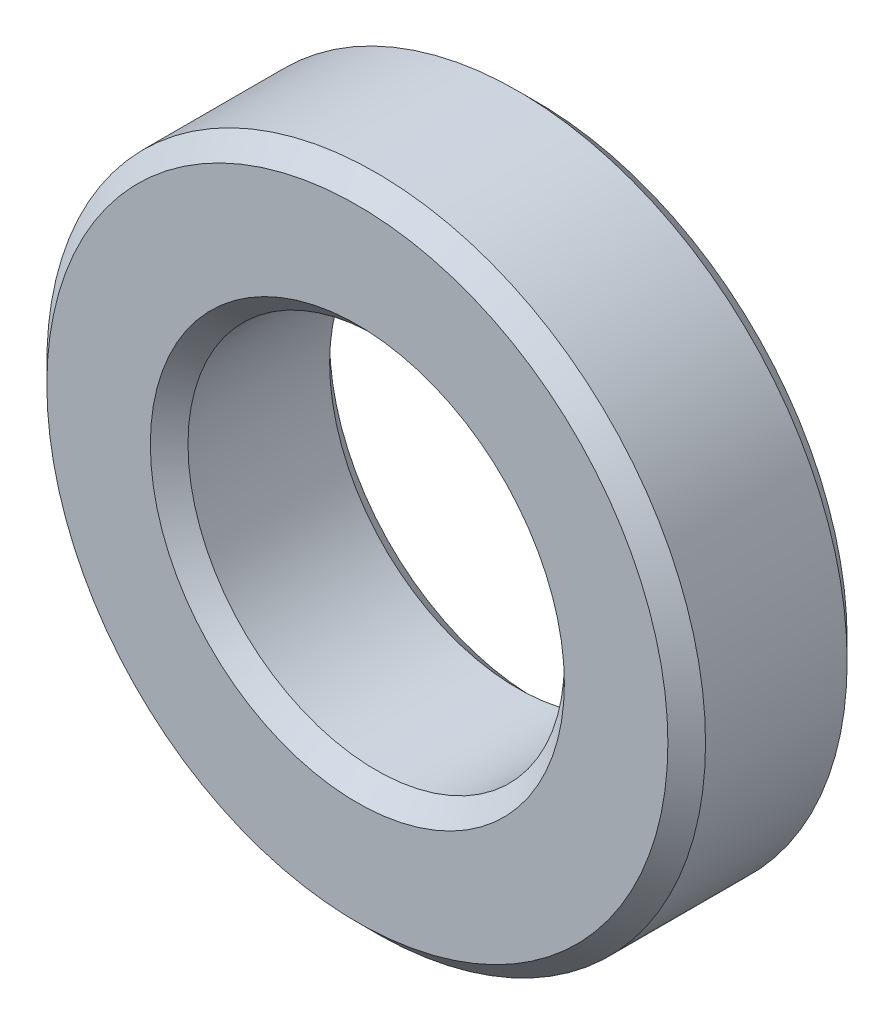
ISO-10303-21;
HEADER;
FILE_DESCRIPTION(('STEP AP214'),'2;1');
FILE_NAME('part.step','',(''),(''),'','','');
FILE_SCHEMA(('AUTOMOTIVE_DESIGN { 1 0 10303 214 1 1 1 1 }'));
ENDSEC;
DATA;
#1=APPLICATION_CONTEXT('core data for automotive mechanical design processes');
#2=APPLICATION_PROTOCOL_DEFINITION('international standard','automotive_design',2000,#1);
#3=PRODUCT_CONTEXT('',#1,'mechanical');
#4=PRODUCT('Part','Part','',(#3));
#5=PRODUCT_RELATED_PRODUCT_CATEGORY('part','',(#4));
#6=PRODUCT_DEFINITION_FORMATION('','',#4);
#7=PRODUCT_DEFINITION_CONTEXT('part definition',#1,'design');
#8=PRODUCT_DEFINITION('design','',#6,#7);
#9=PRODUCT_DEFINITION_SHAPE('','',#8);
#10=(LENGTH_UNIT() NAMED_UNIT(*) SI_UNIT(.MILLI.,.METRE.));
#11=(NAMED_UNIT(*) PLANE_ANGLE_UNIT() SI_UNIT($,.RADIAN.));
#12=(NAMED_UNIT(*) SI_UNIT($,.STERADIAN.) SOLID_ANGLE_UNIT());
#13=UNCERTAINTY_MEASURE_WITH_UNIT(LENGTH_MEASURE(1.E-05),#10,'distance_accuracy_value','');
#14=(GEOMETRIC_REPRESENTATION_CONTEXT(3) GLOBAL_UNCERTAINTY_ASSIGNED_CONTEXT((#13)) GLOBAL_UNIT_ASSIGNED_CONTEXT((#10,
#11,#12)) REPRESENTATION_CONTEXT('',''));
#15=CARTESIAN_POINT('',(0.,0.,0.));
#16=DIRECTION('',(0.,0.,1.));
#17=DIRECTION('',(1.,0.,0.));
#18=AXIS2_PLACEMENT_3D('',#15,#16,#17);
#19=CARTESIAN_POINT('',(0.,0.,9.525));
#20=DIRECTION('',(0.,0.,1.));
#21=DIRECTION('',(1.,0.,0.));
#22=AXIS2_PLACEMENT_3D('',#19,#20,#21);
#23=PLANE('',#22);
#24=CARTESIAN_POINT('',(0.,0.,9.525));
#25=DIRECTION('',(0.,0.,1.));
#26=DIRECTION('',(1.,0.,0.));
#27=AXIS2_PLACEMENT_3D('',#24,#25,#26);
#28=CIRCLE('',#27,11.);
#29=CARTESIAN_POINT('',(11.,0.,9.525));
#30=VERTEX_POINT('',#29);
#31=EDGE_CURVE('E51',#30,#30,#28,.F.);
#32=ORIENTED_EDGE('',*,*,#31,.T.);
#33=EDGE_LOOP('',(#32));
#34=FACE_BOUND('',#33,.T.);
#35=CARTESIAN_POINT('',(0.,0.,9.525));
#36=DIRECTION('',(0.,0.,1.));
#37=DIRECTION('',(1.,0.,0.));
#38=AXIS2_PLACEMENT_3D('',#35,#36,#37);
#39=CIRCLE('',#38,16.5);
#40=CARTESIAN_POINT('',(16.5,0.,9.525));
#41=VERTEX_POINT('',#40);
#42=EDGE_CURVE('E54',#41,#41,#39,.T.);
#43=ORIENTED_EDGE('',*,*,#42,.T.);
#44=EDGE_LOOP('',(#43));
#45=FACE_BOUND('',#44,.T.);
#46=ADVANCED_FACE('F31',(#34,#45),#23,.T.);
#47=CARTESIAN_POINT('',(0.,0.,0.));
#48=DIRECTION('',(0.,0.,1.));
#49=DIRECTION('',(1.,0.,0.));
#50=AXIS2_PLACEMENT_3D('',#47,#48,#49);
#51=PLANE('',#50);
#52=CARTESIAN_POINT('',(0.,0.,0.));
#53=DIRECTION('',(0.,0.,1.));
#54=DIRECTION('',(1.,0.,0.));
#55=AXIS2_PLACEMENT_3D('',#52,#53,#54);
#56=CIRCLE('',#55,11.);
#57=CARTESIAN_POINT('',(11.,0.,0.));
#58=VERTEX_POINT('',#57);
#59=EDGE_CURVE('E42',#58,#58,#56,.T.);
#60=ORIENTED_EDGE('',*,*,#59,.T.);
#61=EDGE_LOOP('',(#60));
#62=FACE_BOUND('',#61,.T.);
#63=CARTESIAN_POINT('',(0.,0.,0.));
#64=DIRECTION('',(0.,0.,1.));
#65=DIRECTION('',(1.,0.,0.));
#66=AXIS2_PLACEMENT_3D('',#63,#64,#65);
#67=CIRCLE('',#66,16.5);
#68=CARTESIAN_POINT('',(16.5,0.,0.));
#69=VERTEX_POINT('',#68);
#70=EDGE_CURVE('E46',#69,#69,#67,.F.);
#71=ORIENTED_EDGE('',*,*,#70,.T.);
#72=EDGE_LOOP('',(#71));
#73=FACE_BOUND('',#72,.T.);
#74=ADVANCED_FACE('F74',(#62,#73),#51,.F.);
#75=CARTESIAN_POINT('',(0.,0.,9.525));
#76=DIRECTION('',(0.,0.,-1.));
#77=DIRECTION('',(-1.,0.,0.));
#78=AXIS2_PLACEMENT_3D('',#75,#76,#77);
#79=CYLINDRICAL_SURFACE('',#78,17.5);
#80=CARTESIAN_POINT('',(0.,0.,1.00000000000003));
#81=DIRECTION('',(0.,0.,1.));
#82=DIRECTION('',(1.,0.,0.));
#83=AXIS2_PLACEMENT_3D('',#80,#81,#82);
#84=CIRCLE('',#83,17.5);
#85=CARTESIAN_POINT('',(17.5,0.,1.00000000000003));
#86=VERTEX_POINT('',#85);
#87=EDGE_CURVE('E10',#86,#86,#84,.T.);
#88=ORIENTED_EDGE('',*,*,#87,.T.);
#89=EDGE_LOOP('',(#88));
#90=FACE_BOUND('',#89,.T.);
#91=CARTESIAN_POINT('',(0.,0.,8.52500000000002));
#92=DIRECTION('',(0.,0.,1.));
#93=DIRECTION('',(1.,0.,0.));
#94=AXIS2_PLACEMENT_3D('',#91,#92,#93);
#95=CIRCLE('',#94,17.5);
#96=CARTESIAN_POINT('',(17.5,0.,8.52500000000002));
#97=VERTEX_POINT('',#96);
#98=EDGE_CURVE('E38',#97,#97,#95,.F.);
#99=ORIENTED_EDGE('',*,*,#98,.T.);
#100=EDGE_LOOP('',(#99));
#101=FACE_BOUND('',#100,.T.);
#102=ADVANCED_FACE('F77',(#90,#101),#79,.T.);
#103=CARTESIAN_POINT('',(0.,0.,9.525));
#104=DIRECTION('',(0.,0.,-1.));
#105=DIRECTION('',(-1.,0.,0.));
#106=AXIS2_PLACEMENT_3D('',#103,#104,#105);
#107=CYLINDRICAL_SURFACE('',#106,10.);
#108=CARTESIAN_POINT('',(0.,0.,8.52499999999998));
#109=DIRECTION('',(0.,0.,1.));
#110=DIRECTION('',(1.,0.,0.));
#111=AXIS2_PLACEMENT_3D('',#108,#109,#110);
#112=CIRCLE('',#111,10.);
#113=CARTESIAN_POINT('',(10.,0.,8.52499999999998));
#114=VERTEX_POINT('',#113);
#115=EDGE_CURVE('E57',#114,#114,#112,.T.);
#116=ORIENTED_EDGE('',*,*,#115,.T.);
#117=EDGE_LOOP('',(#116));
#118=FACE_BOUND('',#117,.T.);
#119=CARTESIAN_POINT('',(0.,0.,0.999999999999984));
#120=DIRECTION('',(0.,0.,1.));
#121=DIRECTION('',(1.,0.,0.));
#122=AXIS2_PLACEMENT_3D('',#119,#120,#121);
#123=CIRCLE('',#122,10.);
#124=CARTESIAN_POINT('',(10.,0.,0.999999999999984));
#125=VERTEX_POINT('',#124);
#126=EDGE_CURVE('E60',#125,#125,#123,.F.);
#127=ORIENTED_EDGE('',*,*,#126,.T.);
#128=EDGE_LOOP('',(#127));
#129=FACE_BOUND('',#128,.T.);
#130=ADVANCED_FACE('F64',(#118,#129),#107,.F.);
#131=CARTESIAN_POINT('',(0.,0.,8.52499999999998));
#132=DIRECTION('',(0.,0.,1.));
#133=DIRECTION('',(1.,0.,0.));
#134=AXIS2_PLACEMENT_3D('',#131,#132,#133);
#135=CONICAL_SURFACE('',#134,10.,0.785398163397448);
#136=ORIENTED_EDGE('',*,*,#31,.F.);
#137=EDGE_LOOP('',(#136));
#138=FACE_BOUND('',#137,.T.);
#139=ORIENTED_EDGE('',*,*,#115,.F.);
#140=EDGE_LOOP('',(#139));
#141=FACE_BOUND('',#140,.T.);
#142=ADVANCED_FACE('F70',(#138,#141),#135,.F.);
#143=CARTESIAN_POINT('',(0.,0.,0.));
#144=DIRECTION('',(0.,0.,-1.));
#145=DIRECTION('',(-1.,0.,0.));
#146=AXIS2_PLACEMENT_3D('',#143,#144,#145);
#147=CONICAL_SURFACE('',#146,11.,0.785398163397448);
#148=ORIENTED_EDGE('',*,*,#126,.F.);
#149=EDGE_LOOP('',(#148));
#150=FACE_BOUND('',#149,.T.);
#151=ORIENTED_EDGE('',*,*,#59,.F.);
#152=EDGE_LOOP('',(#151));
#153=FACE_BOUND('',#152,.T.);
#154=ADVANCED_FACE('F66',(#150,#153),#147,.F.);
#155=CARTESIAN_POINT('',(0.,0.,1.00000000000003));
#156=DIRECTION('',(0.,0.,1.));
#157=DIRECTION('',(1.,0.,0.));
#158=AXIS2_PLACEMENT_3D('',#155,#156,#157);
#159=CONICAL_SURFACE('',#158,17.5,0.785398163397448);
#160=ORIENTED_EDGE('',*,*,#70,.F.);
#161=EDGE_LOOP('',(#160));
#162=FACE_BOUND('',#161,.T.);
#163=ORIENTED_EDGE('',*,*,#87,.F.);
#164=EDGE_LOOP('',(#163));
#165=FACE_BOUND('',#164,.T.);
#166=ADVANCED_FACE('F69',(#162,#165),#159,.T.);
#167=CARTESIAN_POINT('',(0.,0.,9.525));
#168=DIRECTION('',(0.,0.,-1.));
#169=DIRECTION('',(-1.,0.,0.));
#170=AXIS2_PLACEMENT_3D('',#167,#168,#169);
#171=CONICAL_SURFACE('',#170,16.5,0.78539816339745);
#172=ORIENTED_EDGE('',*,*,#98,.F.);
#173=EDGE_LOOP('',(#172));
#174=FACE_BOUND('',#173,.T.);
#175=ORIENTED_EDGE('',*,*,#42,.F.);
#176=EDGE_LOOP('',(#175));
#177=FACE_BOUND('',#176,.T.);
#178=ADVANCED_FACE('F33',(#174,#177),#171,.T.);
#179=CLOSED_SHELL('',(#46,#74,#102,#130,#142,#154,#166,#178));
#180=MANIFOLD_SOLID_BREP('B2',#179);
#181=ADVANCED_BREP_SHAPE_REPRESENTATION('',(#18,#180),#14);
#182=SHAPE_DEFINITION_REPRESENTATION(#9,#181);
ENDSEC;
END-ISO-10303-21;
